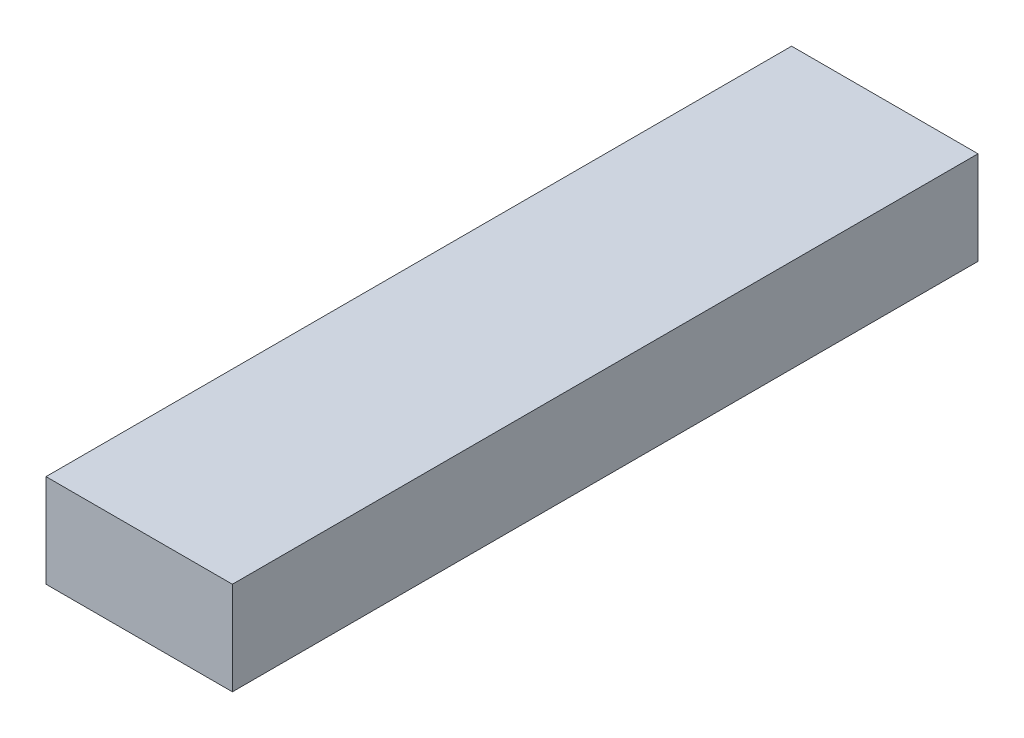
ISO-10303-21;
HEADER;
FILE_DESCRIPTION(('STEP AP214'),'2;1');
FILE_NAME('part.step','',(''),(''),'','','');
FILE_SCHEMA(('AUTOMOTIVE_DESIGN { 1 0 10303 214 1 1 1 1 }'));
ENDSEC;
DATA;
#1=APPLICATION_CONTEXT('core data for automotive mechanical design processes');
#2=APPLICATION_PROTOCOL_DEFINITION('international standard','automotive_design',2000,#1);
#3=PRODUCT_CONTEXT('',#1,'mechanical');
#4=PRODUCT('Part','Part','',(#3));
#5=PRODUCT_RELATED_PRODUCT_CATEGORY('part','',(#4));
#6=PRODUCT_DEFINITION_FORMATION('','',#4);
#7=PRODUCT_DEFINITION_CONTEXT('part definition',#1,'design');
#8=PRODUCT_DEFINITION('design','',#6,#7);
#9=PRODUCT_DEFINITION_SHAPE('','',#8);
#10=(LENGTH_UNIT() NAMED_UNIT(*) SI_UNIT(.MILLI.,.METRE.));
#11=(NAMED_UNIT(*) PLANE_ANGLE_UNIT() SI_UNIT($,.RADIAN.));
#12=(NAMED_UNIT(*) SI_UNIT($,.STERADIAN.) SOLID_ANGLE_UNIT());
#13=UNCERTAINTY_MEASURE_WITH_UNIT(LENGTH_MEASURE(1.E-05),#10,'distance_accuracy_value','');
#14=(GEOMETRIC_REPRESENTATION_CONTEXT(3) GLOBAL_UNCERTAINTY_ASSIGNED_CONTEXT((#13)) GLOBAL_UNIT_ASSIGNED_CONTEXT((#10,
#11,#12)) REPRESENTATION_CONTEXT('',''));
#15=CARTESIAN_POINT('',(0.,0.,0.));
#16=DIRECTION('',(0.,0.,1.));
#17=DIRECTION('',(1.,0.,0.));
#18=AXIS2_PLACEMENT_3D('',#15,#16,#17);
#19=CARTESIAN_POINT('',(5.00000000000001,-2.5,40.));
#20=DIRECTION('',(-1.,0.,0.));
#21=DIRECTION('',(0.,0.,1.));
#22=AXIS2_PLACEMENT_3D('',#19,#20,#21);
#23=PLANE('',#22);
#24=DIRECTION('',(0.,1.,0.));
#25=VECTOR('',#24,1.);
#26=CARTESIAN_POINT('',(5.00000000000001,-2.5,0.));
#27=LINE('',#26,#25);
#28=CARTESIAN_POINT('',(5.00000000000001,-2.5,0.));
#29=VERTEX_POINT('',#28);
#30=CARTESIAN_POINT('',(5.00000000000001,2.5,0.));
#31=VERTEX_POINT('',#30);
#32=EDGE_CURVE('E99',#29,#31,#27,.T.);
#33=ORIENTED_EDGE('',*,*,#32,.T.);
#34=DIRECTION('',(0.,0.,-1.));
#35=VECTOR('',#34,1.);
#36=CARTESIAN_POINT('',(5.00000000000001,2.5,40.));
#37=LINE('',#36,#35);
#38=CARTESIAN_POINT('',(5.00000000000001,2.5,40.));
#39=VERTEX_POINT('',#38);
#40=EDGE_CURVE('E11',#39,#31,#37,.T.);
#41=ORIENTED_EDGE('',*,*,#40,.F.);
#42=DIRECTION('',(0.,1.,0.));
#43=VECTOR('',#42,1.);
#44=CARTESIAN_POINT('',(5.00000000000001,-2.5,40.));
#45=LINE('',#44,#43);
#46=CARTESIAN_POINT('',(5.00000000000001,-2.5,40.));
#47=VERTEX_POINT('',#46);
#48=EDGE_CURVE('E87',#47,#39,#45,.T.);
#49=ORIENTED_EDGE('',*,*,#48,.F.);
#50=DIRECTION('',(0.,0.,-1.));
#51=VECTOR('',#50,1.);
#52=CARTESIAN_POINT('',(5.00000000000001,-2.5,40.));
#53=LINE('',#52,#51);
#54=EDGE_CURVE('E95',#47,#29,#53,.T.);
#55=ORIENTED_EDGE('',*,*,#54,.T.);
#56=EDGE_LOOP('',(#33,#41,#49,#55));
#57=FACE_BOUND('',#56,.T.);
#58=ADVANCED_FACE('F36',(#57),#23,.F.);
#59=CARTESIAN_POINT('',(-4.99999999999999,2.5,40.));
#60=DIRECTION('',(0.,-1.,0.));
#61=DIRECTION('',(0.,0.,-1.));
#62=AXIS2_PLACEMENT_3D('',#59,#60,#61);
#63=PLANE('',#62);
#64=DIRECTION('',(-1.,0.,0.));
#65=VECTOR('',#64,1.);
#66=CARTESIAN_POINT('',(-4.99999999999999,2.5,0.));
#67=LINE('',#66,#65);
#68=CARTESIAN_POINT('',(-4.99999999999999,2.5,0.));
#69=VERTEX_POINT('',#68);
#70=EDGE_CURVE('E91',#31,#69,#67,.T.);
#71=ORIENTED_EDGE('',*,*,#70,.T.);
#72=DIRECTION('',(0.,0.,-1.));
#73=VECTOR('',#72,1.);
#74=CARTESIAN_POINT('',(-4.99999999999999,2.5,40.));
#75=LINE('',#74,#73);
#76=CARTESIAN_POINT('',(-4.99999999999999,2.5,40.));
#77=VERTEX_POINT('',#76);
#78=EDGE_CURVE('E44',#77,#69,#75,.T.);
#79=ORIENTED_EDGE('',*,*,#78,.F.);
#80=DIRECTION('',(-1.,0.,0.));
#81=VECTOR('',#80,1.);
#82=CARTESIAN_POINT('',(-4.99999999999999,2.5,40.));
#83=LINE('',#82,#81);
#84=EDGE_CURVE('E82',#39,#77,#83,.T.);
#85=ORIENTED_EDGE('',*,*,#84,.F.);
#86=ORIENTED_EDGE('',*,*,#40,.T.);
#87=EDGE_LOOP('',(#71,#79,#85,#86));
#88=FACE_BOUND('',#87,.T.);
#89=ADVANCED_FACE('F90',(#88),#63,.F.);
#90=CARTESIAN_POINT('',(-4.99999999999999,-2.5,40.));
#91=DIRECTION('',(1.,0.,0.));
#92=DIRECTION('',(0.,0.,-1.));
#93=AXIS2_PLACEMENT_3D('',#90,#91,#92);
#94=PLANE('',#93);
#95=DIRECTION('',(0.,-1.,0.));
#96=VECTOR('',#95,1.);
#97=CARTESIAN_POINT('',(-4.99999999999999,-2.5,0.));
#98=LINE('',#97,#96);
#99=CARTESIAN_POINT('',(-4.99999999999999,-2.5,0.));
#100=VERTEX_POINT('',#99);
#101=EDGE_CURVE('E69',#69,#100,#98,.T.);
#102=ORIENTED_EDGE('',*,*,#101,.T.);
#103=DIRECTION('',(0.,0.,-1.));
#104=VECTOR('',#103,1.);
#105=CARTESIAN_POINT('',(-4.99999999999999,-2.5,40.));
#106=LINE('',#105,#104);
#107=CARTESIAN_POINT('',(-4.99999999999999,-2.5,40.));
#108=VERTEX_POINT('',#107);
#109=EDGE_CURVE('E92',#108,#100,#106,.T.);
#110=ORIENTED_EDGE('',*,*,#109,.F.);
#111=DIRECTION('',(0.,-1.,0.));
#112=VECTOR('',#111,1.);
#113=CARTESIAN_POINT('',(-4.99999999999999,-2.5,40.));
#114=LINE('',#113,#112);
#115=EDGE_CURVE('E85',#77,#108,#114,.T.);
#116=ORIENTED_EDGE('',*,*,#115,.F.);
#117=ORIENTED_EDGE('',*,*,#78,.T.);
#118=EDGE_LOOP('',(#102,#110,#116,#117));
#119=FACE_BOUND('',#118,.T.);
#120=ADVANCED_FACE('F93',(#119),#94,.F.);
#121=CARTESIAN_POINT('',(-4.99999999999999,-2.5,40.));
#122=DIRECTION('',(0.,1.,0.));
#123=DIRECTION('',(0.,0.,1.));
#124=AXIS2_PLACEMENT_3D('',#121,#122,#123);
#125=PLANE('',#124);
#126=DIRECTION('',(1.,0.,0.));
#127=VECTOR('',#126,1.);
#128=CARTESIAN_POINT('',(-4.99999999999999,-2.5,0.));
#129=LINE('',#128,#127);
#130=EDGE_CURVE('E75',#100,#29,#129,.T.);
#131=ORIENTED_EDGE('',*,*,#130,.T.);
#132=ORIENTED_EDGE('',*,*,#54,.F.);
#133=DIRECTION('',(1.,0.,0.));
#134=VECTOR('',#133,1.);
#135=CARTESIAN_POINT('',(-4.99999999999999,-2.5,40.));
#136=LINE('',#135,#134);
#137=EDGE_CURVE('E52',#108,#47,#136,.T.);
#138=ORIENTED_EDGE('',*,*,#137,.F.);
#139=ORIENTED_EDGE('',*,*,#109,.T.);
#140=EDGE_LOOP('',(#131,#132,#138,#139));
#141=FACE_BOUND('',#140,.T.);
#142=ADVANCED_FACE('F106',(#141),#125,.F.);
#143=CARTESIAN_POINT('',(0.,0.,40.));
#144=DIRECTION('',(0.,0.,-1.));
#145=DIRECTION('',(-1.,0.,0.));
#146=AXIS2_PLACEMENT_3D('',#143,#144,#145);
#147=PLANE('',#146);
#148=ORIENTED_EDGE('',*,*,#48,.T.);
#149=ORIENTED_EDGE('',*,*,#84,.T.);
#150=ORIENTED_EDGE('',*,*,#115,.T.);
#151=ORIENTED_EDGE('',*,*,#137,.T.);
#152=EDGE_LOOP('',(#148,#149,#150,#151));
#153=FACE_BOUND('',#152,.T.);
#154=ADVANCED_FACE('F83',(#153),#147,.F.);
#155=CARTESIAN_POINT('',(0.,0.,0.));
#156=DIRECTION('',(0.,0.,-1.));
#157=DIRECTION('',(-1.,0.,0.));
#158=AXIS2_PLACEMENT_3D('',#155,#156,#157);
#159=PLANE('',#158);
#160=ORIENTED_EDGE('',*,*,#32,.F.);
#161=ORIENTED_EDGE('',*,*,#130,.F.);
#162=ORIENTED_EDGE('',*,*,#101,.F.);
#163=ORIENTED_EDGE('',*,*,#70,.F.);
#164=EDGE_LOOP('',(#160,#161,#162,#163));
#165=FACE_BOUND('',#164,.T.);
#166=ADVANCED_FACE('F109',(#165),#159,.T.);
#167=CLOSED_SHELL('',(#58,#89,#120,#142,#154,#166));
#168=MANIFOLD_SOLID_BREP('B2',#167);
#169=ADVANCED_BREP_SHAPE_REPRESENTATION('',(#18,#168),#14);
#170=SHAPE_DEFINITION_REPRESENTATION(#9,#169);
ENDSEC;
END-ISO-10303-21;
